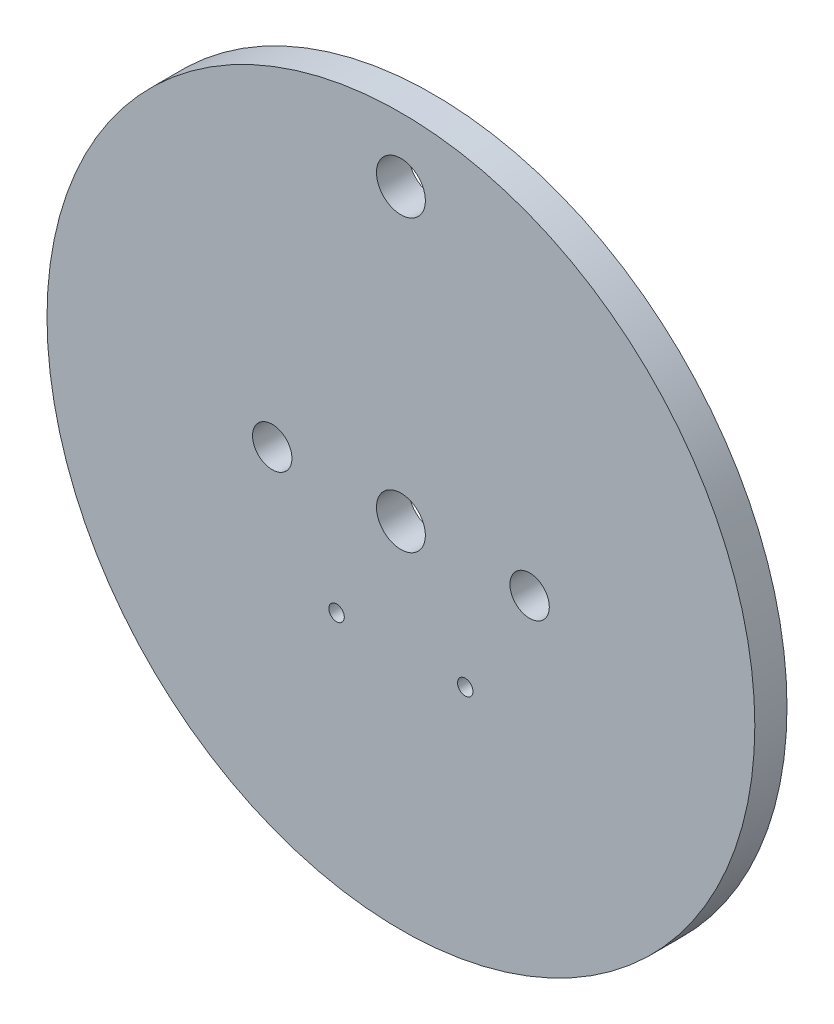
ISO-10303-21;
HEADER;
FILE_DESCRIPTION(('STEP AP214'),'2;1');
FILE_NAME('part.step','',(''),(''),'','','');
FILE_SCHEMA(('AUTOMOTIVE_DESIGN { 1 0 10303 214 1 1 1 1 }'));
ENDSEC;
DATA;
#1=APPLICATION_CONTEXT('core data for automotive mechanical design processes');
#2=APPLICATION_PROTOCOL_DEFINITION('international standard','automotive_design',2000,#1);
#3=PRODUCT_CONTEXT('',#1,'mechanical');
#4=PRODUCT('Part','Part','',(#3));
#5=PRODUCT_RELATED_PRODUCT_CATEGORY('part','',(#4));
#6=PRODUCT_DEFINITION_FORMATION('','',#4);
#7=PRODUCT_DEFINITION_CONTEXT('part definition',#1,'design');
#8=PRODUCT_DEFINITION('design','',#6,#7);
#9=PRODUCT_DEFINITION_SHAPE('','',#8);
#10=(LENGTH_UNIT() NAMED_UNIT(*) SI_UNIT(.MILLI.,.METRE.));
#11=(NAMED_UNIT(*) PLANE_ANGLE_UNIT() SI_UNIT($,.RADIAN.));
#12=(NAMED_UNIT(*) SI_UNIT($,.STERADIAN.) SOLID_ANGLE_UNIT());
#13=UNCERTAINTY_MEASURE_WITH_UNIT(LENGTH_MEASURE(1.E-05),#10,'distance_accuracy_value','');
#14=(GEOMETRIC_REPRESENTATION_CONTEXT(3) GLOBAL_UNCERTAINTY_ASSIGNED_CONTEXT((#13)) GLOBAL_UNIT_ASSIGNED_CONTEXT((#10,
#11,#12)) REPRESENTATION_CONTEXT('',''));
#15=CARTESIAN_POINT('',(0.,0.,0.));
#16=DIRECTION('',(0.,0.,1.));
#17=DIRECTION('',(1.,0.,0.));
#18=AXIS2_PLACEMENT_3D('',#15,#16,#17);
#19=CARTESIAN_POINT('',(67.638168,-28.6031457402461,3.175));
#20=DIRECTION('',(0.,0.,-1.));
#21=DIRECTION('',(-1.,0.,0.));
#22=AXIS2_PLACEMENT_3D('',#19,#20,#21);
#23=CYLINDRICAL_SURFACE('',#22,34.925);
#24=CARTESIAN_POINT('',(67.638168,-28.6031457402461,3.175));
#25=DIRECTION('',(0.,0.,1.));
#26=DIRECTION('',(1.,0.,0.));
#27=AXIS2_PLACEMENT_3D('',#24,#25,#26);
#28=CIRCLE('',#27,34.925);
#29=CARTESIAN_POINT('',(102.563168,-28.6031457402461,3.175));
#30=VERTEX_POINT('',#29);
#31=EDGE_CURVE('E10',#30,#30,#28,.T.);
#32=ORIENTED_EDGE('',*,*,#31,.F.);
#33=EDGE_LOOP('',(#32));
#34=FACE_BOUND('',#33,.T.);
#35=CARTESIAN_POINT('',(67.638168,-28.6031457402461,0.));
#36=DIRECTION('',(0.,0.,1.));
#37=DIRECTION('',(1.,0.,0.));
#38=AXIS2_PLACEMENT_3D('',#35,#36,#37);
#39=CIRCLE('',#38,34.925);
#40=CARTESIAN_POINT('',(102.563168,-28.6031457402461,0.));
#41=VERTEX_POINT('',#40);
#42=EDGE_CURVE('E33',#41,#41,#39,.T.);
#43=ORIENTED_EDGE('',*,*,#42,.T.);
#44=EDGE_LOOP('',(#43));
#45=FACE_BOUND('',#44,.T.);
#46=ADVANCED_FACE('F30',(#34,#45),#23,.T.);
#47=CARTESIAN_POINT('',(67.638168,-28.6031457402461,3.175));
#48=DIRECTION('',(0.,0.,1.));
#49=DIRECTION('',(1.,0.,0.));
#50=AXIS2_PLACEMENT_3D('',#47,#48,#49);
#51=PLANE('',#50);
#52=CARTESIAN_POINT('',(73.988168,-39.6016683683084,3.175));
#53=DIRECTION('',(0.,0.,1.));
#54=DIRECTION('',(1.,0.,0.));
#55=AXIS2_PLACEMENT_3D('',#52,#53,#54);
#56=CIRCLE('',#55,0.762000000000003);
#57=CARTESIAN_POINT('',(74.750168,-39.6016683683084,3.175));
#58=VERTEX_POINT('',#57);
#59=EDGE_CURVE('E74',#58,#58,#56,.T.);
#60=ORIENTED_EDGE('',*,*,#59,.F.);
#61=EDGE_LOOP('',(#60));
#62=FACE_BOUND('',#61,.T.);
#63=CARTESIAN_POINT('',(80.338168,-28.6031457402461,3.175));
#64=DIRECTION('',(0.,0.,1.));
#65=DIRECTION('',(-1.,0.,0.));
#66=AXIS2_PLACEMENT_3D('',#63,#64,#65);
#67=CIRCLE('',#66,1.9431);
#68=CARTESIAN_POINT('',(78.395068,-28.6031457402461,3.175));
#69=VERTEX_POINT('',#68);
#70=EDGE_CURVE('E68',#69,#69,#67,.T.);
#71=ORIENTED_EDGE('',*,*,#70,.F.);
#72=EDGE_LOOP('',(#71));
#73=FACE_BOUND('',#72,.T.);
#74=CARTESIAN_POINT('',(61.288168,-39.6016683683084,3.175));
#75=DIRECTION('',(0.,0.,1.));
#76=DIRECTION('',(1.,0.,0.));
#77=AXIS2_PLACEMENT_3D('',#74,#75,#76);
#78=CIRCLE('',#77,0.761999999999996);
#79=CARTESIAN_POINT('',(62.050168,-39.6016683683084,3.175));
#80=VERTEX_POINT('',#79);
#81=EDGE_CURVE('E62',#80,#80,#78,.T.);
#82=ORIENTED_EDGE('',*,*,#81,.F.);
#83=EDGE_LOOP('',(#82));
#84=FACE_BOUND('',#83,.T.);
#85=CARTESIAN_POINT('',(54.938168,-28.6031457402461,3.175));
#86=DIRECTION('',(0.,0.,1.));
#87=DIRECTION('',(1.,0.,0.));
#88=AXIS2_PLACEMENT_3D('',#85,#86,#87);
#89=CIRCLE('',#88,1.9431);
#90=CARTESIAN_POINT('',(56.881268,-28.6031457402461,3.175));
#91=VERTEX_POINT('',#90);
#92=EDGE_CURVE('E56',#91,#91,#89,.T.);
#93=ORIENTED_EDGE('',*,*,#92,.F.);
#94=EDGE_LOOP('',(#93));
#95=FACE_BOUND('',#94,.T.);
#96=CARTESIAN_POINT('',(67.638168,-28.6031457402461,3.175));
#97=DIRECTION('',(0.,0.,1.));
#98=DIRECTION('',(1.,0.,0.));
#99=AXIS2_PLACEMENT_3D('',#96,#97,#98);
#100=CIRCLE('',#99,2.41299999999999);
#101=CARTESIAN_POINT('',(70.051168,-28.6031457402461,3.175));
#102=VERTEX_POINT('',#101);
#103=EDGE_CURVE('E50',#102,#102,#100,.T.);
#104=ORIENTED_EDGE('',*,*,#103,.F.);
#105=EDGE_LOOP('',(#104));
#106=FACE_BOUND('',#105,.T.);
#107=CARTESIAN_POINT('',(67.638168,0.,3.175));
#108=DIRECTION('',(0.,0.,1.));
#109=DIRECTION('',(1.,0.,0.));
#110=AXIS2_PLACEMENT_3D('',#107,#108,#109);
#111=CIRCLE('',#110,2.413);
#112=CARTESIAN_POINT('',(70.051168,0.,3.175));
#113=VERTEX_POINT('',#112);
#114=EDGE_CURVE('E44',#113,#113,#111,.T.);
#115=ORIENTED_EDGE('',*,*,#114,.F.);
#116=EDGE_LOOP('',(#115));
#117=FACE_BOUND('',#116,.T.);
#118=ORIENTED_EDGE('',*,*,#31,.T.);
#119=EDGE_LOOP('',(#118));
#120=FACE_BOUND('',#119,.T.);
#121=ADVANCED_FACE('F81',(#62,#73,#84,#95,#106,#117,#120),#51,.T.);
#122=CARTESIAN_POINT('',(67.638168,-28.6031457402461,0.));
#123=DIRECTION('',(0.,0.,1.));
#124=DIRECTION('',(1.,0.,0.));
#125=AXIS2_PLACEMENT_3D('',#122,#123,#124);
#126=PLANE('',#125);
#127=CARTESIAN_POINT('',(73.988168,-39.6016683683084,0.));
#128=DIRECTION('',(0.,0.,1.));
#129=DIRECTION('',(1.,0.,0.));
#130=AXIS2_PLACEMENT_3D('',#127,#128,#129);
#131=CIRCLE('',#130,0.762000000000003);
#132=CARTESIAN_POINT('',(74.750168,-39.6016683683084,0.));
#133=VERTEX_POINT('',#132);
#134=EDGE_CURVE('E71',#133,#133,#131,.F.);
#135=ORIENTED_EDGE('',*,*,#134,.F.);
#136=EDGE_LOOP('',(#135));
#137=FACE_BOUND('',#136,.T.);
#138=CARTESIAN_POINT('',(80.338168,-28.6031457402461,0.));
#139=DIRECTION('',(0.,0.,1.));
#140=DIRECTION('',(1.,0.,0.));
#141=AXIS2_PLACEMENT_3D('',#138,#139,#140);
#142=CIRCLE('',#141,1.9431);
#143=CARTESIAN_POINT('',(82.281268,-28.6031457402461,0.));
#144=VERTEX_POINT('',#143);
#145=EDGE_CURVE('E65',#144,#144,#142,.F.);
#146=ORIENTED_EDGE('',*,*,#145,.F.);
#147=EDGE_LOOP('',(#146));
#148=FACE_BOUND('',#147,.T.);
#149=CARTESIAN_POINT('',(61.288168,-39.6016683683084,0.));
#150=DIRECTION('',(0.,0.,1.));
#151=DIRECTION('',(1.,0.,0.));
#152=AXIS2_PLACEMENT_3D('',#149,#150,#151);
#153=CIRCLE('',#152,0.761999999999996);
#154=CARTESIAN_POINT('',(62.050168,-39.6016683683084,0.));
#155=VERTEX_POINT('',#154);
#156=EDGE_CURVE('E59',#155,#155,#153,.F.);
#157=ORIENTED_EDGE('',*,*,#156,.F.);
#158=EDGE_LOOP('',(#157));
#159=FACE_BOUND('',#158,.T.);
#160=CARTESIAN_POINT('',(54.938168,-28.6031457402461,0.));
#161=DIRECTION('',(0.,0.,1.));
#162=DIRECTION('',(1.,0.,0.));
#163=AXIS2_PLACEMENT_3D('',#160,#161,#162);
#164=CIRCLE('',#163,1.9431);
#165=CARTESIAN_POINT('',(56.881268,-28.6031457402461,0.));
#166=VERTEX_POINT('',#165);
#167=EDGE_CURVE('E53',#166,#166,#164,.F.);
#168=ORIENTED_EDGE('',*,*,#167,.F.);
#169=EDGE_LOOP('',(#168));
#170=FACE_BOUND('',#169,.T.);
#171=CARTESIAN_POINT('',(67.638168,-28.6031457402461,0.));
#172=DIRECTION('',(0.,0.,1.));
#173=DIRECTION('',(1.,0.,0.));
#174=AXIS2_PLACEMENT_3D('',#171,#172,#173);
#175=CIRCLE('',#174,2.41299999999999);
#176=CARTESIAN_POINT('',(70.051168,-28.6031457402461,0.));
#177=VERTEX_POINT('',#176);
#178=EDGE_CURVE('E47',#177,#177,#175,.F.);
#179=ORIENTED_EDGE('',*,*,#178,.F.);
#180=EDGE_LOOP('',(#179));
#181=FACE_BOUND('',#180,.T.);
#182=CARTESIAN_POINT('',(67.638168,0.,0.));
#183=DIRECTION('',(0.,0.,1.));
#184=DIRECTION('',(1.,0.,0.));
#185=AXIS2_PLACEMENT_3D('',#182,#183,#184);
#186=CIRCLE('',#185,2.413);
#187=CARTESIAN_POINT('',(70.051168,0.,0.));
#188=VERTEX_POINT('',#187);
#189=EDGE_CURVE('E40',#188,#188,#186,.F.);
#190=ORIENTED_EDGE('',*,*,#189,.F.);
#191=EDGE_LOOP('',(#190));
#192=FACE_BOUND('',#191,.T.);
#193=ORIENTED_EDGE('',*,*,#42,.F.);
#194=EDGE_LOOP('',(#193));
#195=FACE_BOUND('',#194,.T.);
#196=ADVANCED_FACE('F84',(#137,#148,#159,#170,#181,#192,#195),#126,.F.);
#197=CARTESIAN_POINT('',(67.638168,0.,-0.00100000000000013));
#198=DIRECTION('',(0.,0.,1.));
#199=DIRECTION('',(1.,0.,0.));
#200=AXIS2_PLACEMENT_3D('',#197,#198,#199);
#201=CYLINDRICAL_SURFACE('',#200,2.413);
#202=ORIENTED_EDGE('',*,*,#114,.T.);
#203=EDGE_LOOP('',(#202));
#204=FACE_BOUND('',#203,.T.);
#205=ORIENTED_EDGE('',*,*,#189,.T.);
#206=EDGE_LOOP('',(#205));
#207=FACE_BOUND('',#206,.T.);
#208=ADVANCED_FACE('F96',(#204,#207),#201,.F.);
#209=CARTESIAN_POINT('',(67.638168,-28.6031457402461,-0.00100000000000013));
#210=DIRECTION('',(0.,0.,1.));
#211=DIRECTION('',(1.,0.,0.));
#212=AXIS2_PLACEMENT_3D('',#209,#210,#211);
#213=CYLINDRICAL_SURFACE('',#212,2.41299999999999);
#214=ORIENTED_EDGE('',*,*,#103,.T.);
#215=EDGE_LOOP('',(#214));
#216=FACE_BOUND('',#215,.T.);
#217=ORIENTED_EDGE('',*,*,#178,.T.);
#218=EDGE_LOOP('',(#217));
#219=FACE_BOUND('',#218,.T.);
#220=ADVANCED_FACE('F99',(#216,#219),#213,.F.);
#221=CARTESIAN_POINT('',(54.938168,-28.6031457402461,-0.00100000000000013));
#222=DIRECTION('',(0.,0.,1.));
#223=DIRECTION('',(1.,0.,0.));
#224=AXIS2_PLACEMENT_3D('',#221,#222,#223);
#225=CYLINDRICAL_SURFACE('',#224,1.9431);
#226=ORIENTED_EDGE('',*,*,#92,.T.);
#227=EDGE_LOOP('',(#226));
#228=FACE_BOUND('',#227,.T.);
#229=ORIENTED_EDGE('',*,*,#167,.T.);
#230=EDGE_LOOP('',(#229));
#231=FACE_BOUND('',#230,.T.);
#232=ADVANCED_FACE('F131',(#228,#231),#225,.F.);
#233=CARTESIAN_POINT('',(61.288168,-39.6016683683084,-0.00100000000000013));
#234=DIRECTION('',(0.,0.,1.));
#235=DIRECTION('',(1.,0.,0.));
#236=AXIS2_PLACEMENT_3D('',#233,#234,#235);
#237=CYLINDRICAL_SURFACE('',#236,0.761999999999996);
#238=ORIENTED_EDGE('',*,*,#81,.T.);
#239=EDGE_LOOP('',(#238));
#240=FACE_BOUND('',#239,.T.);
#241=ORIENTED_EDGE('',*,*,#156,.T.);
#242=EDGE_LOOP('',(#241));
#243=FACE_BOUND('',#242,.T.);
#244=ADVANCED_FACE('F138',(#240,#243),#237,.F.);
#245=CARTESIAN_POINT('',(80.338168,-28.6031457402461,-0.00100000000000013));
#246=DIRECTION('',(0.,0.,1.));
#247=DIRECTION('',(1.,0.,0.));
#248=AXIS2_PLACEMENT_3D('',#245,#246,#247);
#249=CYLINDRICAL_SURFACE('',#248,1.9431);
#250=ORIENTED_EDGE('',*,*,#70,.T.);
#251=EDGE_LOOP('',(#250));
#252=FACE_BOUND('',#251,.T.);
#253=ORIENTED_EDGE('',*,*,#145,.T.);
#254=EDGE_LOOP('',(#253));
#255=FACE_BOUND('',#254,.T.);
#256=ADVANCED_FACE('F146',(#252,#255),#249,.F.);
#257=CARTESIAN_POINT('',(73.988168,-39.6016683683084,-0.00100000000000013));
#258=DIRECTION('',(0.,0.,1.));
#259=DIRECTION('',(1.,0.,0.));
#260=AXIS2_PLACEMENT_3D('',#257,#258,#259);
#261=CYLINDRICAL_SURFACE('',#260,0.762000000000003);
#262=ORIENTED_EDGE('',*,*,#59,.T.);
#263=EDGE_LOOP('',(#262));
#264=FACE_BOUND('',#263,.T.);
#265=ORIENTED_EDGE('',*,*,#134,.T.);
#266=EDGE_LOOP('',(#265));
#267=FACE_BOUND('',#266,.T.);
#268=ADVANCED_FACE('F78',(#264,#267),#261,.F.);
#269=CLOSED_SHELL('',(#46,#121,#196,#208,#220,#232,#244,#256,#268));
#270=MANIFOLD_SOLID_BREP('B2',#269);
#271=ADVANCED_BREP_SHAPE_REPRESENTATION('',(#18,#270),#14);
#272=SHAPE_DEFINITION_REPRESENTATION(#9,#271);
ENDSEC;
END-ISO-10303-21;
